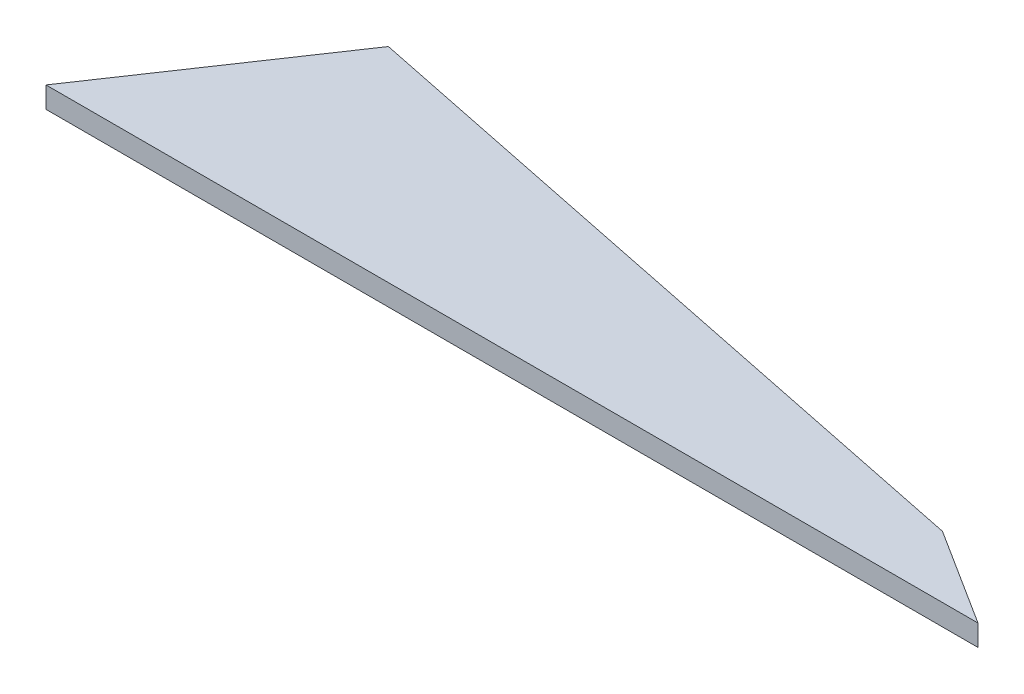
ISO-10303-21;
HEADER;
FILE_DESCRIPTION(('STEP AP214'),'2;1');
FILE_NAME('part.step','',(''),(''),'','','');
FILE_SCHEMA(('AUTOMOTIVE_DESIGN { 1 0 10303 214 1 1 1 1 }'));
ENDSEC;
DATA;
#1=APPLICATION_CONTEXT('core data for automotive mechanical design processes');
#2=APPLICATION_PROTOCOL_DEFINITION('international standard','automotive_design',2000,#1);
#3=PRODUCT_CONTEXT('',#1,'mechanical');
#4=PRODUCT('Part','Part','',(#3));
#5=PRODUCT_RELATED_PRODUCT_CATEGORY('part','',(#4));
#6=PRODUCT_DEFINITION_FORMATION('','',#4);
#7=PRODUCT_DEFINITION_CONTEXT('part definition',#1,'design');
#8=PRODUCT_DEFINITION('design','',#6,#7);
#9=PRODUCT_DEFINITION_SHAPE('','',#8);
#10=(LENGTH_UNIT() NAMED_UNIT(*) SI_UNIT(.MILLI.,.METRE.));
#11=(NAMED_UNIT(*) PLANE_ANGLE_UNIT() SI_UNIT($,.RADIAN.));
#12=(NAMED_UNIT(*) SI_UNIT($,.STERADIAN.) SOLID_ANGLE_UNIT());
#13=UNCERTAINTY_MEASURE_WITH_UNIT(LENGTH_MEASURE(1.E-05),#10,'distance_accuracy_value','');
#14=(GEOMETRIC_REPRESENTATION_CONTEXT(3) GLOBAL_UNCERTAINTY_ASSIGNED_CONTEXT((#13)) GLOBAL_UNIT_ASSIGNED_CONTEXT((#10,
#11,#12)) REPRESENTATION_CONTEXT('',''));
#15=CARTESIAN_POINT('',(0.,0.,0.));
#16=DIRECTION('',(0.,0.,1.));
#17=DIRECTION('',(1.,0.,0.));
#18=AXIS2_PLACEMENT_3D('',#15,#16,#17);
#19=CARTESIAN_POINT('',(0.,2.,0.));
#20=DIRECTION('',(0.,0.,-1.));
#21=DIRECTION('',(-1.,0.,0.));
#22=AXIS2_PLACEMENT_3D('',#19,#20,#21);
#23=PLANE('',#22);
#24=DIRECTION('',(1.,0.,0.));
#25=VECTOR('',#24,1.);
#26=CARTESIAN_POINT('',(0.,0.,0.));
#27=LINE('',#26,#25);
#28=CARTESIAN_POINT('',(0.,0.,0.));
#29=VERTEX_POINT('',#28);
#30=CARTESIAN_POINT('',(88.0490751695004,0.,0.));
#31=VERTEX_POINT('',#30);
#32=EDGE_CURVE('E107',#29,#31,#27,.T.);
#33=ORIENTED_EDGE('',*,*,#32,.T.);
#34=DIRECTION('',(0.,-1.,0.));
#35=VECTOR('',#34,1.);
#36=CARTESIAN_POINT('',(88.0490751695004,2.,0.));
#37=LINE('',#36,#35);
#38=CARTESIAN_POINT('',(88.0490751695004,2.,0.));
#39=VERTEX_POINT('',#38);
#40=EDGE_CURVE('E11',#39,#31,#37,.T.);
#41=ORIENTED_EDGE('',*,*,#40,.F.);
#42=DIRECTION('',(1.,0.,0.));
#43=VECTOR('',#42,1.);
#44=CARTESIAN_POINT('',(0.,2.,0.));
#45=LINE('',#44,#43);
#46=CARTESIAN_POINT('',(0.,2.,0.));
#47=VERTEX_POINT('',#46);
#48=EDGE_CURVE('E91',#47,#39,#45,.T.);
#49=ORIENTED_EDGE('',*,*,#48,.F.);
#50=DIRECTION('',(0.,-1.,0.));
#51=VECTOR('',#50,1.);
#52=CARTESIAN_POINT('',(0.,2.,0.));
#53=LINE('',#52,#51);
#54=EDGE_CURVE('E103',#47,#29,#53,.T.);
#55=ORIENTED_EDGE('',*,*,#54,.T.);
#56=EDGE_LOOP('',(#33,#41,#49,#55));
#57=FACE_BOUND('',#56,.T.);
#58=ADVANCED_FACE('F39',(#57),#23,.F.);
#59=CARTESIAN_POINT('',(88.0490751695004,2.,0.));
#60=DIRECTION('',(-0.535755262246191,0.,0.844373317304328));
#61=DIRECTION('',(0.844373317304328,0.,0.535755262246191));
#62=AXIS2_PLACEMENT_3D('',#59,#60,#61);
#63=PLANE('',#62);
#64=DIRECTION('',(-0.844373317304328,0.,-0.535755262246191));
#65=VECTOR('',#64,1.);
#66=CARTESIAN_POINT('',(88.0490751695004,0.,0.));
#67=LINE('',#66,#65);
#68=CARTESIAN_POINT('',(78.8609997257406,0.,-5.82983813915938));
#69=VERTEX_POINT('',#68);
#70=EDGE_CURVE('E96',#31,#69,#67,.T.);
#71=ORIENTED_EDGE('',*,*,#70,.T.);
#72=DIRECTION('',(0.,-1.,0.));
#73=VECTOR('',#72,1.);
#74=CARTESIAN_POINT('',(78.8609997257406,2.,-5.82983813915938));
#75=LINE('',#74,#73);
#76=CARTESIAN_POINT('',(78.8609997257406,2.,-5.82983813915938));
#77=VERTEX_POINT('',#76);
#78=EDGE_CURVE('E48',#77,#69,#75,.T.);
#79=ORIENTED_EDGE('',*,*,#78,.F.);
#80=DIRECTION('',(-0.844373317304328,0.,-0.535755262246191));
#81=VECTOR('',#80,1.);
#82=CARTESIAN_POINT('',(88.0490751695004,2.,0.));
#83=LINE('',#82,#81);
#84=EDGE_CURVE('E86',#39,#77,#83,.T.);
#85=ORIENTED_EDGE('',*,*,#84,.F.);
#86=ORIENTED_EDGE('',*,*,#40,.T.);
#87=EDGE_LOOP('',(#71,#79,#85,#86));
#88=FACE_BOUND('',#87,.T.);
#89=ADVANCED_FACE('F95',(#88),#63,.F.);
#90=CARTESIAN_POINT('',(78.8609997257406,2.,-5.82983813915938));
#91=DIRECTION('',(-0.200672284033904,0.,0.979658427422852));
#92=DIRECTION('',(0.979658427422852,0.,0.200672284033904));
#93=AXIS2_PLACEMENT_3D('',#90,#91,#92);
#94=PLANE('',#93);
#95=DIRECTION('',(-0.979658427422852,0.,-0.200672284033904));
#96=VECTOR('',#95,1.);
#97=CARTESIAN_POINT('',(78.8609997257406,0.,-5.82983813915938));
#98=LINE('',#97,#96);
#99=CARTESIAN_POINT('',(13.0306951450572,0.,-19.3144540104332));
#100=VERTEX_POINT('',#99);
#101=EDGE_CURVE('E73',#69,#100,#98,.T.);
#102=ORIENTED_EDGE('',*,*,#101,.T.);
#103=DIRECTION('',(0.,-1.,0.));
#104=VECTOR('',#103,1.);
#105=CARTESIAN_POINT('',(13.0306951450572,2.,-19.3144540104332));
#106=LINE('',#105,#104);
#107=CARTESIAN_POINT('',(13.0306951450572,2.,-19.3144540104332));
#108=VERTEX_POINT('',#107);
#109=EDGE_CURVE('E98',#108,#100,#106,.T.);
#110=ORIENTED_EDGE('',*,*,#109,.F.);
#111=DIRECTION('',(-0.979658427422852,0.,-0.200672284033904));
#112=VECTOR('',#111,1.);
#113=CARTESIAN_POINT('',(78.8609997257406,2.,-5.82983813915938));
#114=LINE('',#113,#112);
#115=EDGE_CURVE('E89',#77,#108,#114,.T.);
#116=ORIENTED_EDGE('',*,*,#115,.F.);
#117=ORIENTED_EDGE('',*,*,#78,.T.);
#118=EDGE_LOOP('',(#102,#110,#116,#117));
#119=FACE_BOUND('',#118,.T.);
#120=ADVANCED_FACE('F99',(#119),#94,.F.);
#121=CARTESIAN_POINT('',(13.0306951450572,2.,-19.3144540104332));
#122=DIRECTION('',(0.828979240370148,0.,0.559279374763035));
#123=DIRECTION('',(0.559279374763035,0.,-0.828979240370148));
#124=AXIS2_PLACEMENT_3D('',#121,#122,#123);
#125=PLANE('',#124);
#126=DIRECTION('',(-0.559279374763035,0.,0.828979240370148));
#127=VECTOR('',#126,1.);
#128=CARTESIAN_POINT('',(13.0306951450572,0.,-19.3144540104332));
#129=LINE('',#128,#127);
#130=EDGE_CURVE('E79',#100,#29,#129,.T.);
#131=ORIENTED_EDGE('',*,*,#130,.T.);
#132=ORIENTED_EDGE('',*,*,#54,.F.);
#133=DIRECTION('',(-0.559279374763035,0.,0.828979240370148));
#134=VECTOR('',#133,1.);
#135=CARTESIAN_POINT('',(13.0306951450572,2.,-19.3144540104332));
#136=LINE('',#135,#134);
#137=EDGE_CURVE('E56',#108,#47,#136,.T.);
#138=ORIENTED_EDGE('',*,*,#137,.F.);
#139=ORIENTED_EDGE('',*,*,#109,.T.);
#140=EDGE_LOOP('',(#131,#132,#138,#139));
#141=FACE_BOUND('',#140,.T.);
#142=ADVANCED_FACE('F120',(#141),#125,.F.);
#143=CARTESIAN_POINT('',(0.,2.,0.));
#144=DIRECTION('',(0.,-1.,0.));
#145=DIRECTION('',(0.,0.,-1.));
#146=AXIS2_PLACEMENT_3D('',#143,#144,#145);
#147=PLANE('',#146);
#148=ORIENTED_EDGE('',*,*,#48,.T.);
#149=ORIENTED_EDGE('',*,*,#84,.T.);
#150=ORIENTED_EDGE('',*,*,#115,.T.);
#151=ORIENTED_EDGE('',*,*,#137,.T.);
#152=EDGE_LOOP('',(#148,#149,#150,#151));
#153=FACE_BOUND('',#152,.T.);
#154=ADVANCED_FACE('F87',(#153),#147,.F.);
#155=CARTESIAN_POINT('',(0.,0.,0.));
#156=DIRECTION('',(0.,-1.,0.));
#157=DIRECTION('',(0.,0.,-1.));
#158=AXIS2_PLACEMENT_3D('',#155,#156,#157);
#159=PLANE('',#158);
#160=ORIENTED_EDGE('',*,*,#32,.F.);
#161=ORIENTED_EDGE('',*,*,#130,.F.);
#162=ORIENTED_EDGE('',*,*,#101,.F.);
#163=ORIENTED_EDGE('',*,*,#70,.F.);
#164=EDGE_LOOP('',(#160,#161,#162,#163));
#165=FACE_BOUND('',#164,.T.);
#166=ADVANCED_FACE('F123',(#165),#159,.T.);
#167=CLOSED_SHELL('',(#58,#89,#120,#142,#154,#166));
#168=MANIFOLD_SOLID_BREP('B2',#167);
#169=ADVANCED_BREP_SHAPE_REPRESENTATION('',(#18,#168),#14);
#170=SHAPE_DEFINITION_REPRESENTATION(#9,#169);
ENDSEC;
END-ISO-10303-21;
